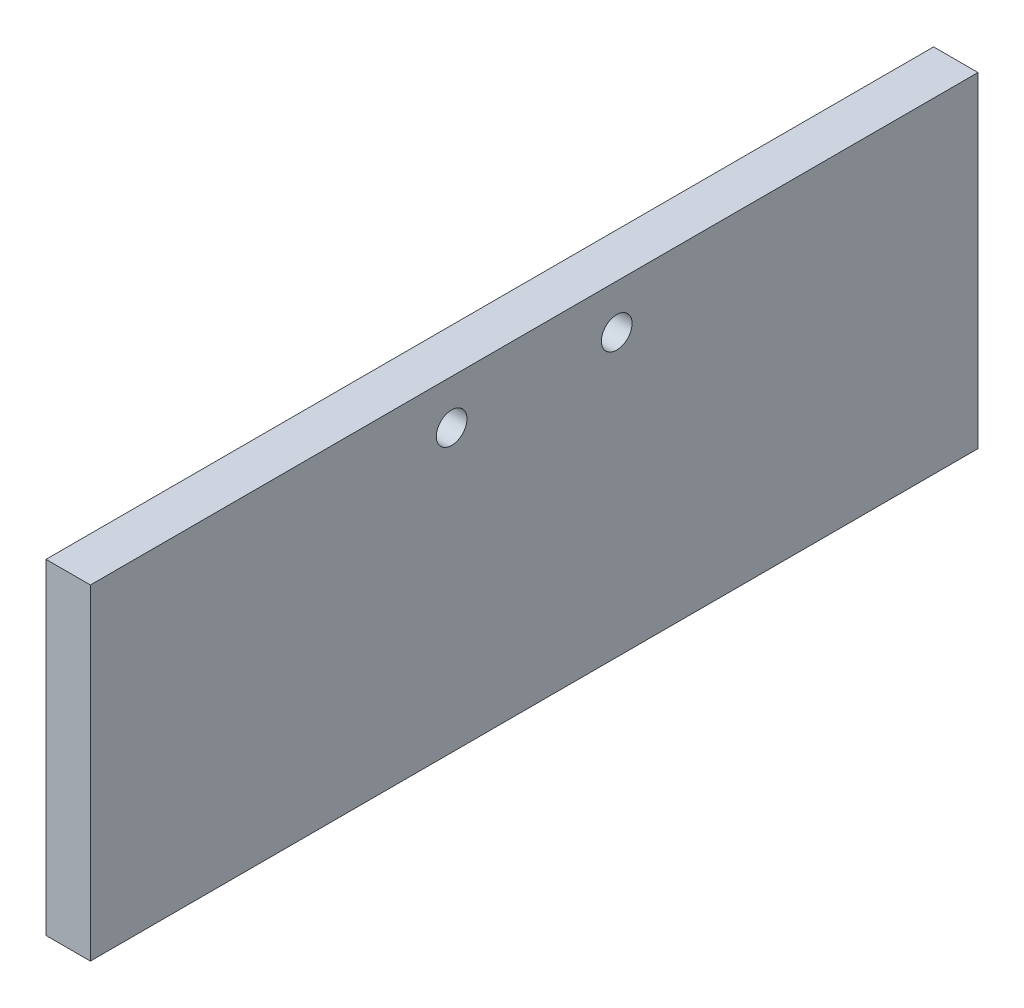
ISO-10303-21;
HEADER;
FILE_DESCRIPTION(('STEP AP214'),'2;1');
FILE_NAME('part.step','',(''),(''),'','','');
FILE_SCHEMA(('AUTOMOTIVE_DESIGN { 1 0 10303 214 1 1 1 1 }'));
ENDSEC;
DATA;
#1=APPLICATION_CONTEXT('core data for automotive mechanical design processes');
#2=APPLICATION_PROTOCOL_DEFINITION('international standard','automotive_design',2000,#1);
#3=PRODUCT_CONTEXT('',#1,'mechanical');
#4=PRODUCT('Part','Part','',(#3));
#5=PRODUCT_RELATED_PRODUCT_CATEGORY('part','',(#4));
#6=PRODUCT_DEFINITION_FORMATION('','',#4);
#7=PRODUCT_DEFINITION_CONTEXT('part definition',#1,'design');
#8=PRODUCT_DEFINITION('design','',#6,#7);
#9=PRODUCT_DEFINITION_SHAPE('','',#8);
#10=(LENGTH_UNIT() NAMED_UNIT(*) SI_UNIT(.MILLI.,.METRE.));
#11=(NAMED_UNIT(*) PLANE_ANGLE_UNIT() SI_UNIT($,.RADIAN.));
#12=(NAMED_UNIT(*) SI_UNIT($,.STERADIAN.) SOLID_ANGLE_UNIT());
#13=UNCERTAINTY_MEASURE_WITH_UNIT(LENGTH_MEASURE(1.E-05),#10,'distance_accuracy_value','');
#14=(GEOMETRIC_REPRESENTATION_CONTEXT(3) GLOBAL_UNCERTAINTY_ASSIGNED_CONTEXT((#13)) GLOBAL_UNIT_ASSIGNED_CONTEXT((#10,
#11,#12)) REPRESENTATION_CONTEXT('',''));
#15=CARTESIAN_POINT('',(0.,0.,0.));
#16=DIRECTION('',(0.,0.,1.));
#17=DIRECTION('',(1.,0.,0.));
#18=AXIS2_PLACEMENT_3D('',#15,#16,#17);
#19=CARTESIAN_POINT('',(6.35,-16.9545,-63.5));
#20=DIRECTION('',(0.,0.,-1.));
#21=DIRECTION('',(-1.,0.,0.));
#22=AXIS2_PLACEMENT_3D('',#19,#20,#21);
#23=PLANE('',#22);
#24=DIRECTION('',(0.,-1.,0.));
#25=VECTOR('',#24,1.);
#26=CARTESIAN_POINT('',(0.,-16.9545,-63.5));
#27=LINE('',#26,#25);
#28=CARTESIAN_POINT('',(0.,6.35,-63.5));
#29=VERTEX_POINT('',#28);
#30=CARTESIAN_POINT('',(0.,-40.259,-63.5));
#31=VERTEX_POINT('',#30);
#32=EDGE_CURVE('E107',#29,#31,#27,.T.);
#33=ORIENTED_EDGE('',*,*,#32,.F.);
#34=DIRECTION('',(-1.,0.,0.));
#35=VECTOR('',#34,1.);
#36=CARTESIAN_POINT('',(6.35,6.35,-63.5));
#37=LINE('',#36,#35);
#38=CARTESIAN_POINT('',(6.35,6.35,-63.5));
#39=VERTEX_POINT('',#38);
#40=EDGE_CURVE('E11',#39,#29,#37,.T.);
#41=ORIENTED_EDGE('',*,*,#40,.F.);
#42=DIRECTION('',(0.,-1.,0.));
#43=VECTOR('',#42,1.);
#44=CARTESIAN_POINT('',(6.35,-16.9545,-63.5));
#45=LINE('',#44,#43);
#46=CARTESIAN_POINT('',(6.35,-40.259,-63.5));
#47=VERTEX_POINT('',#46);
#48=EDGE_CURVE('E94',#39,#47,#45,.T.);
#49=ORIENTED_EDGE('',*,*,#48,.T.);
#50=DIRECTION('',(-1.,0.,0.));
#51=VECTOR('',#50,1.);
#52=CARTESIAN_POINT('',(6.35,-40.259,-63.5));
#53=LINE('',#52,#51);
#54=EDGE_CURVE('E73',#47,#31,#53,.T.);
#55=ORIENTED_EDGE('',*,*,#54,.T.);
#56=EDGE_LOOP('',(#33,#41,#49,#55));
#57=FACE_BOUND('',#56,.T.);
#58=ADVANCED_FACE('F33',(#57),#23,.T.);
#59=CARTESIAN_POINT('',(6.35,6.35,-105.366638500252));
#60=DIRECTION('',(0.,1.,0.));
#61=DIRECTION('',(0.,0.,1.));
#62=AXIS2_PLACEMENT_3D('',#59,#60,#61);
#63=PLANE('',#62);
#64=DIRECTION('',(0.,0.,-1.));
#65=VECTOR('',#64,1.);
#66=CARTESIAN_POINT('',(0.,6.35,-105.366638500252));
#67=LINE('',#66,#65);
#68=CARTESIAN_POINT('',(0.,6.35,63.5));
#69=VERTEX_POINT('',#68);
#70=EDGE_CURVE('E85',#69,#29,#67,.T.);
#71=ORIENTED_EDGE('',*,*,#70,.F.);
#72=DIRECTION('',(-1.,0.,0.));
#73=VECTOR('',#72,1.);
#74=CARTESIAN_POINT('',(6.35,6.35,63.5));
#75=LINE('',#74,#73);
#76=CARTESIAN_POINT('',(6.35,6.35,63.5));
#77=VERTEX_POINT('',#76);
#78=EDGE_CURVE('E42',#77,#69,#75,.T.);
#79=ORIENTED_EDGE('',*,*,#78,.F.);
#80=DIRECTION('',(0.,0.,-1.));
#81=VECTOR('',#80,1.);
#82=CARTESIAN_POINT('',(6.35,6.35,-105.366638500252));
#83=LINE('',#82,#81);
#84=EDGE_CURVE('E83',#77,#39,#83,.T.);
#85=ORIENTED_EDGE('',*,*,#84,.T.);
#86=ORIENTED_EDGE('',*,*,#40,.T.);
#87=EDGE_LOOP('',(#71,#79,#85,#86));
#88=FACE_BOUND('',#87,.T.);
#89=ADVANCED_FACE('F81',(#88),#63,.T.);
#90=CARTESIAN_POINT('',(6.35,-16.9545,63.5));
#91=DIRECTION('',(0.,0.,-1.));
#92=DIRECTION('',(-1.,0.,0.));
#93=AXIS2_PLACEMENT_3D('',#90,#91,#92);
#94=PLANE('',#93);
#95=DIRECTION('',(0.,-1.,0.));
#96=VECTOR('',#95,1.);
#97=CARTESIAN_POINT('',(0.,-16.9545,63.5));
#98=LINE('',#97,#96);
#99=CARTESIAN_POINT('',(0.,-40.259,63.5));
#100=VERTEX_POINT('',#99);
#101=EDGE_CURVE('E110',#69,#100,#98,.T.);
#102=ORIENTED_EDGE('',*,*,#101,.T.);
#103=DIRECTION('',(-1.,0.,0.));
#104=VECTOR('',#103,1.);
#105=CARTESIAN_POINT('',(6.35,-40.259,63.5));
#106=LINE('',#105,#104);
#107=CARTESIAN_POINT('',(6.35,-40.259,63.5));
#108=VERTEX_POINT('',#107);
#109=EDGE_CURVE('E88',#108,#100,#106,.T.);
#110=ORIENTED_EDGE('',*,*,#109,.F.);
#111=DIRECTION('',(0.,-1.,0.));
#112=VECTOR('',#111,1.);
#113=CARTESIAN_POINT('',(6.35,-16.9545,63.5));
#114=LINE('',#113,#112);
#115=EDGE_CURVE('E90',#77,#108,#114,.T.);
#116=ORIENTED_EDGE('',*,*,#115,.F.);
#117=ORIENTED_EDGE('',*,*,#78,.T.);
#118=EDGE_LOOP('',(#102,#110,#116,#117));
#119=FACE_BOUND('',#118,.T.);
#120=ADVANCED_FACE('F91',(#119),#94,.F.);
#121=CARTESIAN_POINT('',(6.35,0.,11.811));
#122=DIRECTION('',(-1.,0.,0.));
#123=DIRECTION('',(0.,0.,1.));
#124=AXIS2_PLACEMENT_3D('',#121,#122,#123);
#125=CYLINDRICAL_SURFACE('',#124,2.1971);
#126=CARTESIAN_POINT('',(6.35,0.,11.811));
#127=DIRECTION('',(1.,0.,0.));
#128=DIRECTION('',(0.,0.,-1.));
#129=AXIS2_PLACEMENT_3D('',#126,#127,#128);
#130=CIRCLE('',#129,2.1971);
#131=CARTESIAN_POINT('',(6.35,0.,9.6139));
#132=VERTEX_POINT('',#131);
#133=EDGE_CURVE('E96',#132,#132,#130,.T.);
#134=ORIENTED_EDGE('',*,*,#133,.T.);
#135=EDGE_LOOP('',(#134));
#136=FACE_BOUND('',#135,.T.);
#137=CARTESIAN_POINT('',(0.,0.,11.811));
#138=DIRECTION('',(1.,0.,0.));
#139=DIRECTION('',(0.,0.,-1.));
#140=AXIS2_PLACEMENT_3D('',#137,#138,#139);
#141=CIRCLE('',#140,2.1971);
#142=CARTESIAN_POINT('',(0.,0.,9.6139));
#143=VERTEX_POINT('',#142);
#144=EDGE_CURVE('E104',#143,#143,#141,.T.);
#145=ORIENTED_EDGE('',*,*,#144,.F.);
#146=EDGE_LOOP('',(#145));
#147=FACE_BOUND('',#146,.T.);
#148=ADVANCED_FACE('F125',(#136,#147),#125,.F.);
#149=CARTESIAN_POINT('',(6.35,0.,-11.811));
#150=DIRECTION('',(-1.,0.,0.));
#151=DIRECTION('',(0.,0.,1.));
#152=AXIS2_PLACEMENT_3D('',#149,#150,#151);
#153=CYLINDRICAL_SURFACE('',#152,2.1971);
#154=CARTESIAN_POINT('',(6.35,0.,-11.811));
#155=DIRECTION('',(1.,0.,0.));
#156=DIRECTION('',(0.,0.,-1.));
#157=AXIS2_PLACEMENT_3D('',#154,#155,#156);
#158=CIRCLE('',#157,2.1971);
#159=CARTESIAN_POINT('',(6.35,0.,-14.0081));
#160=VERTEX_POINT('',#159);
#161=EDGE_CURVE('E113',#160,#160,#158,.T.);
#162=ORIENTED_EDGE('',*,*,#161,.T.);
#163=EDGE_LOOP('',(#162));
#164=FACE_BOUND('',#163,.T.);
#165=CARTESIAN_POINT('',(0.,0.,-11.811));
#166=DIRECTION('',(1.,0.,0.));
#167=DIRECTION('',(0.,0.,-1.));
#168=AXIS2_PLACEMENT_3D('',#165,#166,#167);
#169=CIRCLE('',#168,2.1971);
#170=CARTESIAN_POINT('',(0.,0.,-14.0081));
#171=VERTEX_POINT('',#170);
#172=EDGE_CURVE('E101',#171,#171,#169,.T.);
#173=ORIENTED_EDGE('',*,*,#172,.F.);
#174=EDGE_LOOP('',(#173));
#175=FACE_BOUND('',#174,.T.);
#176=ADVANCED_FACE('F35',(#164,#175),#153,.F.);
#177=CARTESIAN_POINT('',(6.35,-40.259,-105.366638500252));
#178=DIRECTION('',(0.,1.,0.));
#179=DIRECTION('',(0.,0.,1.));
#180=AXIS2_PLACEMENT_3D('',#177,#178,#179);
#181=PLANE('',#180);
#182=DIRECTION('',(0.,0.,-1.));
#183=VECTOR('',#182,1.);
#184=CARTESIAN_POINT('',(0.,-40.259,-105.366638500252));
#185=LINE('',#184,#183);
#186=EDGE_CURVE('E66',#100,#31,#185,.T.);
#187=ORIENTED_EDGE('',*,*,#186,.T.);
#188=ORIENTED_EDGE('',*,*,#54,.F.);
#189=DIRECTION('',(0.,0.,-1.));
#190=VECTOR('',#189,1.);
#191=CARTESIAN_POINT('',(6.35,-40.259,-105.366638500252));
#192=LINE('',#191,#190);
#193=EDGE_CURVE('E50',#108,#47,#192,.T.);
#194=ORIENTED_EDGE('',*,*,#193,.F.);
#195=ORIENTED_EDGE('',*,*,#109,.T.);
#196=EDGE_LOOP('',(#187,#188,#194,#195));
#197=FACE_BOUND('',#196,.T.);
#198=ADVANCED_FACE('F116',(#197),#181,.F.);
#199=CARTESIAN_POINT('',(6.35,-16.9545,-105.366638500252));
#200=DIRECTION('',(1.,0.,0.));
#201=DIRECTION('',(0.,0.,-1.));
#202=AXIS2_PLACEMENT_3D('',#199,#200,#201);
#203=PLANE('',#202);
#204=ORIENTED_EDGE('',*,*,#161,.F.);
#205=EDGE_LOOP('',(#204));
#206=FACE_BOUND('',#205,.T.);
#207=ORIENTED_EDGE('',*,*,#133,.F.);
#208=EDGE_LOOP('',(#207));
#209=FACE_BOUND('',#208,.T.);
#210=ORIENTED_EDGE('',*,*,#48,.F.);
#211=ORIENTED_EDGE('',*,*,#84,.F.);
#212=ORIENTED_EDGE('',*,*,#115,.T.);
#213=ORIENTED_EDGE('',*,*,#193,.T.);
#214=EDGE_LOOP('',(#210,#211,#212,#213));
#215=FACE_BOUND('',#214,.T.);
#216=ADVANCED_FACE('F93',(#206,#209,#215),#203,.T.);
#217=CARTESIAN_POINT('',(0.,-16.9545,-105.366638500252));
#218=DIRECTION('',(1.,0.,0.));
#219=DIRECTION('',(0.,0.,-1.));
#220=AXIS2_PLACEMENT_3D('',#217,#218,#219);
#221=PLANE('',#220);
#222=ORIENTED_EDGE('',*,*,#172,.T.);
#223=EDGE_LOOP('',(#222));
#224=FACE_BOUND('',#223,.T.);
#225=ORIENTED_EDGE('',*,*,#144,.T.);
#226=EDGE_LOOP('',(#225));
#227=FACE_BOUND('',#226,.T.);
#228=ORIENTED_EDGE('',*,*,#32,.T.);
#229=ORIENTED_EDGE('',*,*,#186,.F.);
#230=ORIENTED_EDGE('',*,*,#101,.F.);
#231=ORIENTED_EDGE('',*,*,#70,.T.);
#232=EDGE_LOOP('',(#228,#229,#230,#231));
#233=FACE_BOUND('',#232,.T.);
#234=ADVANCED_FACE('F117',(#224,#227,#233),#221,.F.);
#235=CLOSED_SHELL('',(#58,#89,#120,#148,#176,#198,#216,#234));
#236=MANIFOLD_SOLID_BREP('B2',#235);
#237=ADVANCED_BREP_SHAPE_REPRESENTATION('',(#18,#236),#14);
#238=SHAPE_DEFINITION_REPRESENTATION(#9,#237);
ENDSEC;
END-ISO-10303-21;
